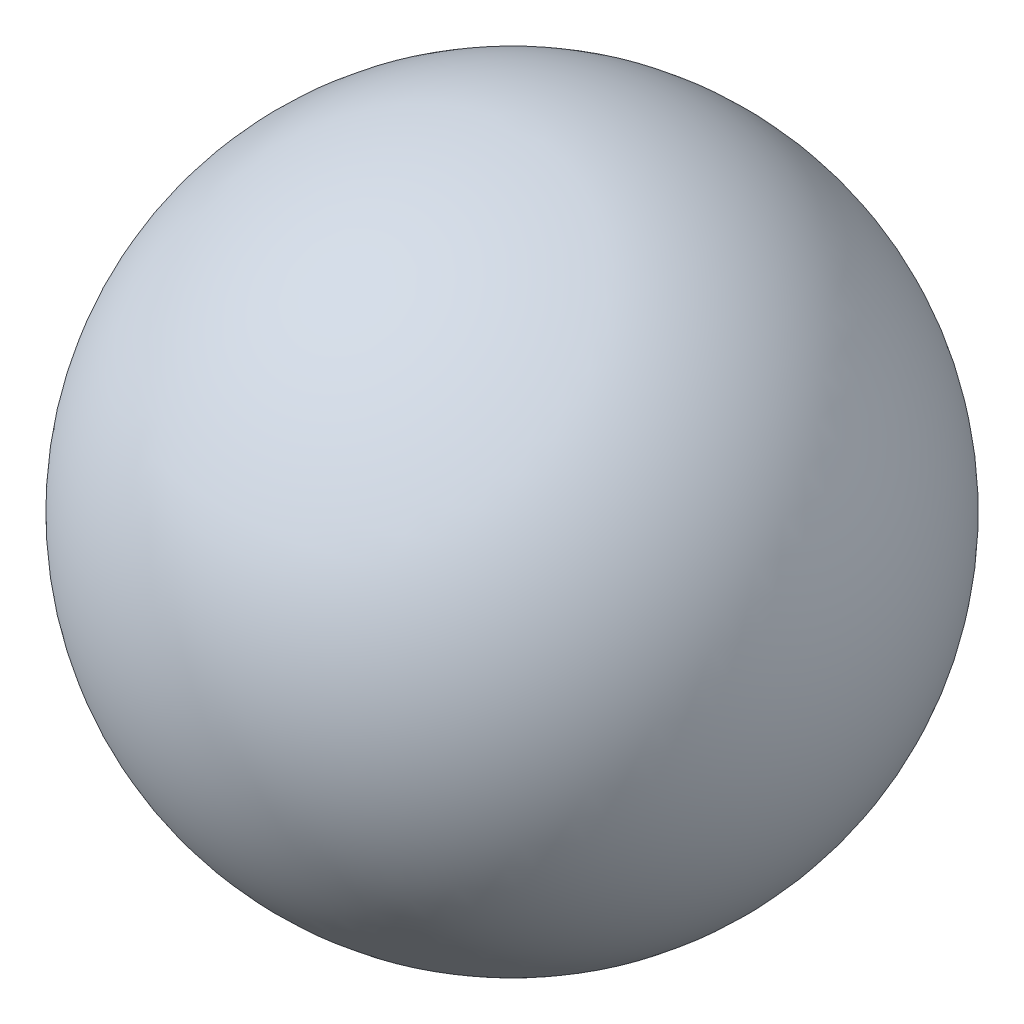
ISO-10303-21;
HEADER;
FILE_DESCRIPTION(('STEP AP214'),'2;1');
FILE_NAME('part.step','',(''),(''),'','','');
FILE_SCHEMA(('AUTOMOTIVE_DESIGN { 1 0 10303 214 1 1 1 1 }'));
ENDSEC;
DATA;
#1=APPLICATION_CONTEXT('core data for automotive mechanical design processes');
#2=APPLICATION_PROTOCOL_DEFINITION('international standard','automotive_design',2000,#1);
#3=PRODUCT_CONTEXT('',#1,'mechanical');
#4=PRODUCT('Part','Part','',(#3));
#5=PRODUCT_RELATED_PRODUCT_CATEGORY('part','',(#4));
#6=PRODUCT_DEFINITION_FORMATION('','',#4);
#7=PRODUCT_DEFINITION_CONTEXT('part definition',#1,'design');
#8=PRODUCT_DEFINITION('design','',#6,#7);
#9=PRODUCT_DEFINITION_SHAPE('','',#8);
#10=(LENGTH_UNIT() NAMED_UNIT(*) SI_UNIT(.MILLI.,.METRE.));
#11=(NAMED_UNIT(*) PLANE_ANGLE_UNIT() SI_UNIT($,.RADIAN.));
#12=(NAMED_UNIT(*) SI_UNIT($,.STERADIAN.) SOLID_ANGLE_UNIT());
#13=UNCERTAINTY_MEASURE_WITH_UNIT(LENGTH_MEASURE(1.E-05),#10,'distance_accuracy_value','');
#14=(GEOMETRIC_REPRESENTATION_CONTEXT(3) GLOBAL_UNCERTAINTY_ASSIGNED_CONTEXT((#13)) GLOBAL_UNIT_ASSIGNED_CONTEXT((#10,
#11,#12)) REPRESENTATION_CONTEXT('',''));
#15=CARTESIAN_POINT('',(0.,0.,0.));
#16=DIRECTION('',(0.,0.,1.));
#17=DIRECTION('',(1.,0.,0.));
#18=AXIS2_PLACEMENT_3D('',#15,#16,#17);
#19=CARTESIAN_POINT('',(0.,0.,0.));
#20=DIRECTION('',(0.,1.,0.));
#21=DIRECTION('',(1.,0.,0.));
#22=AXIS2_PLACEMENT_3D('',#19,#20,#21);
#23=SPHERICAL_SURFACE('',#22,304.8);
#24=CARTESIAN_POINT('',(0.,304.8,0.));
#25=VERTEX_POINT('',#24);
#26=VERTEX_LOOP('',#25);
#27=FACE_BOUND('',#26,.T.);
#28=ADVANCED_FACE('F29',(#27),#23,.T.);
#29=CLOSED_SHELL('',(#28));
#30=MANIFOLD_SOLID_BREP('B2',#29);
#31=ADVANCED_BREP_SHAPE_REPRESENTATION('',(#18,#30),#14);
#32=SHAPE_DEFINITION_REPRESENTATION(#9,#31);
ENDSEC;
END-ISO-10303-21;
